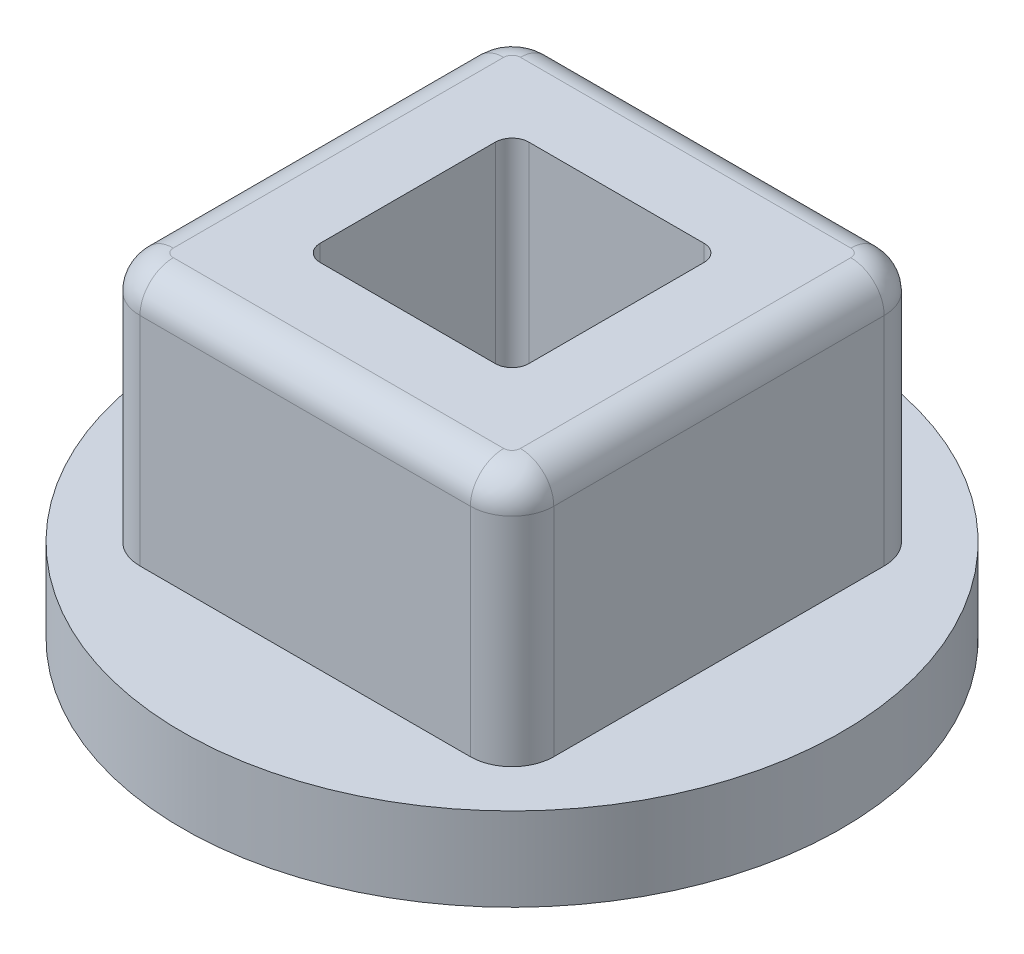
ISO-10303-21;
HEADER;
FILE_DESCRIPTION(('STEP AP214'),'2;1');
FILE_NAME('part.step','',(''),(''),'','','');
FILE_SCHEMA(('AUTOMOTIVE_DESIGN { 1 0 10303 214 1 1 1 1 }'));
ENDSEC;
DATA;
#1=APPLICATION_CONTEXT('core data for automotive mechanical design processes');
#2=APPLICATION_PROTOCOL_DEFINITION('international standard','automotive_design',2000,#1);
#3=PRODUCT_CONTEXT('',#1,'mechanical');
#4=PRODUCT('Part','Part','',(#3));
#5=PRODUCT_RELATED_PRODUCT_CATEGORY('part','',(#4));
#6=PRODUCT_DEFINITION_FORMATION('','',#4);
#7=PRODUCT_DEFINITION_CONTEXT('part definition',#1,'design');
#8=PRODUCT_DEFINITION('design','',#6,#7);
#9=PRODUCT_DEFINITION_SHAPE('','',#8);
#10=(LENGTH_UNIT() NAMED_UNIT(*) SI_UNIT(.MILLI.,.METRE.));
#11=(NAMED_UNIT(*) PLANE_ANGLE_UNIT() SI_UNIT($,.RADIAN.));
#12=(NAMED_UNIT(*) SI_UNIT($,.STERADIAN.) SOLID_ANGLE_UNIT());
#13=UNCERTAINTY_MEASURE_WITH_UNIT(LENGTH_MEASURE(1.E-05),#10,'distance_accuracy_value','');
#14=(GEOMETRIC_REPRESENTATION_CONTEXT(3) GLOBAL_UNCERTAINTY_ASSIGNED_CONTEXT((#13)) GLOBAL_UNIT_ASSIGNED_CONTEXT((#10,
#11,#12)) REPRESENTATION_CONTEXT('',''));
#15=CARTESIAN_POINT('',(0.,0.,0.));
#16=DIRECTION('',(0.,0.,1.));
#17=DIRECTION('',(1.,0.,0.));
#18=AXIS2_PLACEMENT_3D('',#15,#16,#17);
#19=CARTESIAN_POINT('',(-2.5146,5.08,2.5146));
#20=DIRECTION('',(0.,-1.,0.));
#21=DIRECTION('',(0.,0.,-1.));
#22=AXIS2_PLACEMENT_3D('',#19,#20,#21);
#23=CYLINDRICAL_SURFACE('',#22,0.635);
#24=DIRECTION('',(0.,1.,0.));
#25=VECTOR('',#24,1.);
#26=CARTESIAN_POINT('',(-3.1496,5.08,2.51460000000017));
#27=LINE('',#26,#25);
#28=CARTESIAN_POINT('',(-3.14960000000013,4.572,2.5146000000011));
#29=VERTEX_POINT('',#28);
#30=CARTESIAN_POINT('',(-3.1496,1.27,2.51460000000009));
#31=VERTEX_POINT('',#30);
#32=EDGE_CURVE('E98',#29,#31,#27,.F.);
#33=ORIENTED_EDGE('',*,*,#32,.T.);
#34=CARTESIAN_POINT('',(-2.5146,1.27,2.5146));
#35=DIRECTION('',(0.,-1.,0.));
#36=DIRECTION('',(0.,0.,-1.));
#37=AXIS2_PLACEMENT_3D('',#34,#35,#36);
#38=CIRCLE('',#37,0.635);
#39=CARTESIAN_POINT('',(-2.5146,1.27,3.1496));
#40=VERTEX_POINT('',#39);
#41=EDGE_CURVE('E19',#31,#40,#38,.F.);
#42=ORIENTED_EDGE('',*,*,#41,.T.);
#43=DIRECTION('',(0.,1.,0.));
#44=VECTOR('',#43,1.);
#45=CARTESIAN_POINT('',(-2.5146,5.08,3.1496));
#46=LINE('',#45,#44);
#47=CARTESIAN_POINT('',(-2.51460000000036,4.572,3.14959999999985));
#48=VERTEX_POINT('',#47);
#49=EDGE_CURVE('E96',#40,#48,#46,.T.);
#50=ORIENTED_EDGE('',*,*,#49,.T.);
#51=CARTESIAN_POINT('',(-2.51460000000043,4.572,2.51459999999958));
#52=DIRECTION('',(0.,-1.,0.));
#53=DIRECTION('',(0.,0.,-1.));
#54=AXIS2_PLACEMENT_3D('',#51,#52,#53);
#55=CIRCLE('',#54,0.634999999999828);
#56=EDGE_CURVE('E357',#29,#48,#55,.F.);
#57=ORIENTED_EDGE('',*,*,#56,.F.);
#58=EDGE_LOOP('',(#33,#42,#50,#57));
#59=FACE_BOUND('',#58,.T.);
#60=ADVANCED_FACE('F16',(#59),#23,.T.);
#61=CARTESIAN_POINT('',(-2.5146,5.08,-2.5146));
#62=DIRECTION('',(0.,-1.,0.));
#63=DIRECTION('',(0.,0.,-1.));
#64=AXIS2_PLACEMENT_3D('',#61,#62,#63);
#65=CYLINDRICAL_SURFACE('',#64,0.635);
#66=DIRECTION('',(0.,1.,0.));
#67=VECTOR('',#66,1.);
#68=CARTESIAN_POINT('',(-2.51460000000017,5.08,-3.1496));
#69=LINE('',#68,#67);
#70=CARTESIAN_POINT('',(-2.51459999999987,4.572,-3.14960000000006));
#71=VERTEX_POINT('',#70);
#72=CARTESIAN_POINT('',(-2.51460000000009,1.27,-3.1496));
#73=VERTEX_POINT('',#72);
#74=EDGE_CURVE('E245',#71,#73,#69,.F.);
#75=ORIENTED_EDGE('',*,*,#74,.T.);
#76=CARTESIAN_POINT('',(-2.5146,1.27,-2.5146));
#77=DIRECTION('',(0.,-1.,0.));
#78=DIRECTION('',(0.,0.,-1.));
#79=AXIS2_PLACEMENT_3D('',#76,#77,#78);
#80=CIRCLE('',#79,0.635);
#81=CARTESIAN_POINT('',(-3.1496,1.27,-2.5146));
#82=VERTEX_POINT('',#81);
#83=EDGE_CURVE('E100',#73,#82,#80,.F.);
#84=ORIENTED_EDGE('',*,*,#83,.T.);
#85=DIRECTION('',(0.,1.,0.));
#86=VECTOR('',#85,1.);
#87=CARTESIAN_POINT('',(-3.1496,5.08,-2.5146));
#88=LINE('',#87,#86);
#89=CARTESIAN_POINT('',(-3.1495999999997,4.572,-2.5146));
#90=VERTEX_POINT('',#89);
#91=EDGE_CURVE('E258',#82,#90,#88,.T.);
#92=ORIENTED_EDGE('',*,*,#91,.T.);
#93=CARTESIAN_POINT('',(-2.51459999999958,4.572,-2.51460000000043));
#94=DIRECTION('',(0.,-1.,0.));
#95=DIRECTION('',(0.,0.,-1.));
#96=AXIS2_PLACEMENT_3D('',#93,#94,#95);
#97=CIRCLE('',#96,0.634999999999828);
#98=EDGE_CURVE('E271',#71,#90,#97,.F.);
#99=ORIENTED_EDGE('',*,*,#98,.F.);
#100=EDGE_LOOP('',(#75,#84,#92,#99));
#101=FACE_BOUND('',#100,.T.);
#102=ADVANCED_FACE('F432',(#101),#65,.T.);
#103=CARTESIAN_POINT('',(2.5146,5.08,2.5146));
#104=DIRECTION('',(0.,-1.,0.));
#105=DIRECTION('',(0.,0.,-1.));
#106=AXIS2_PLACEMENT_3D('',#103,#104,#105);
#107=CYLINDRICAL_SURFACE('',#106,0.635);
#108=DIRECTION('',(0.,1.,0.));
#109=VECTOR('',#108,1.);
#110=CARTESIAN_POINT('',(2.51460000000009,5.08,3.1496));
#111=LINE('',#110,#109);
#112=CARTESIAN_POINT('',(2.51460000000106,4.572,3.14960000000013));
#113=VERTEX_POINT('',#112);
#114=CARTESIAN_POINT('',(2.51460000000004,1.27,3.1496));
#115=VERTEX_POINT('',#114);
#116=EDGE_CURVE('E261',#113,#115,#111,.F.);
#117=ORIENTED_EDGE('',*,*,#116,.T.);
#118=CARTESIAN_POINT('',(2.5146,1.27,2.5146));
#119=DIRECTION('',(0.,-1.,0.));
#120=DIRECTION('',(0.,0.,-1.));
#121=AXIS2_PLACEMENT_3D('',#118,#119,#120);
#122=CIRCLE('',#121,0.635);
#123=CARTESIAN_POINT('',(3.1496,1.27,2.5146));
#124=VERTEX_POINT('',#123);
#125=EDGE_CURVE('E113',#115,#124,#122,.F.);
#126=ORIENTED_EDGE('',*,*,#125,.T.);
#127=DIRECTION('',(0.,1.,0.));
#128=VECTOR('',#127,1.);
#129=CARTESIAN_POINT('',(3.1496,5.08,2.5146));
#130=LINE('',#129,#128);
#131=CARTESIAN_POINT('',(3.14959999999985,4.572,2.5146));
#132=VERTEX_POINT('',#131);
#133=EDGE_CURVE('E242',#124,#132,#130,.T.);
#134=ORIENTED_EDGE('',*,*,#133,.T.);
#135=CARTESIAN_POINT('',(2.51459999999958,4.572,2.51460000000043));
#136=DIRECTION('',(0.,-1.,0.));
#137=DIRECTION('',(0.,0.,-1.));
#138=AXIS2_PLACEMENT_3D('',#135,#136,#137);
#139=CIRCLE('',#138,0.634999999999828);
#140=EDGE_CURVE('E327',#113,#132,#139,.F.);
#141=ORIENTED_EDGE('',*,*,#140,.F.);
#142=EDGE_LOOP('',(#117,#126,#134,#141));
#143=FACE_BOUND('',#142,.T.);
#144=ADVANCED_FACE('F662',(#143),#107,.T.);
#145=CARTESIAN_POINT('',(2.5146,5.08,-2.5146));
#146=DIRECTION('',(0.,-1.,0.));
#147=DIRECTION('',(0.,0.,-1.));
#148=AXIS2_PLACEMENT_3D('',#145,#146,#147);
#149=CYLINDRICAL_SURFACE('',#148,0.635);
#150=DIRECTION('',(0.,1.,0.));
#151=VECTOR('',#150,1.);
#152=CARTESIAN_POINT('',(3.1496,5.08,-2.51460000000017));
#153=LINE('',#152,#151);
#154=CARTESIAN_POINT('',(3.14960000000013,4.572,-2.5146000000011));
#155=VERTEX_POINT('',#154);
#156=CARTESIAN_POINT('',(3.1496,1.27,-2.51460000000009));
#157=VERTEX_POINT('',#156);
#158=EDGE_CURVE('E235',#155,#157,#153,.F.);
#159=ORIENTED_EDGE('',*,*,#158,.T.);
#160=CARTESIAN_POINT('',(2.5146,1.27,-2.5146));
#161=DIRECTION('',(0.,-1.,0.));
#162=DIRECTION('',(0.,0.,-1.));
#163=AXIS2_PLACEMENT_3D('',#160,#161,#162);
#164=CIRCLE('',#163,0.635);
#165=CARTESIAN_POINT('',(2.5146,1.27,-3.1496));
#166=VERTEX_POINT('',#165);
#167=EDGE_CURVE('E378',#157,#166,#164,.F.);
#168=ORIENTED_EDGE('',*,*,#167,.T.);
#169=DIRECTION('',(0.,1.,0.));
#170=VECTOR('',#169,1.);
#171=CARTESIAN_POINT('',(2.5146,5.08,-3.1496));
#172=LINE('',#171,#170);
#173=CARTESIAN_POINT('',(2.51460000000011,4.572,-3.14959999999985));
#174=VERTEX_POINT('',#173);
#175=EDGE_CURVE('E248',#166,#174,#172,.T.);
#176=ORIENTED_EDGE('',*,*,#175,.T.);
#177=CARTESIAN_POINT('',(2.51460000000043,4.572,-2.51459999999958));
#178=DIRECTION('',(0.,-1.,0.));
#179=DIRECTION('',(0.,0.,-1.));
#180=AXIS2_PLACEMENT_3D('',#177,#178,#179);
#181=CIRCLE('',#180,0.634999999999828);
#182=EDGE_CURVE('E298',#155,#174,#181,.F.);
#183=ORIENTED_EDGE('',*,*,#182,.F.);
#184=EDGE_LOOP('',(#159,#168,#176,#183));
#185=FACE_BOUND('',#184,.T.);
#186=ADVANCED_FACE('F498',(#185),#149,.T.);
#187=CARTESIAN_POINT('',(-2.6416,4.572,2.538898108304));
#188=DIRECTION('',(0.,0.,-1.));
#189=DIRECTION('',(-1.,0.,0.));
#190=AXIS2_PLACEMENT_3D('',#187,#188,#189);
#191=CYLINDRICAL_SURFACE('',#190,0.508);
#192=CARTESIAN_POINT('',(-2.64160000000059,4.57200000000093,2.51460000000007));
#193=DIRECTION('',(-3.86198346587602E-12,0.,-1.));
#194=DIRECTION('',(-1.,0.,3.86198346587602E-12));
#195=AXIS2_PLACEMENT_3D('',#192,#193,#194);
#196=CIRCLE('',#195,0.507999999999662);
#197=CARTESIAN_POINT('',(-2.6415999981047,5.08000000000029,2.51460000000007));
#198=VERTEX_POINT('',#197);
#199=EDGE_CURVE('E202',#198,#29,#196,.F.);
#200=ORIENTED_EDGE('',*,*,#199,.F.);
#201=DIRECTION('',(0.,0.,1.));
#202=VECTOR('',#201,1.);
#203=CARTESIAN_POINT('',(-2.6416,5.08,3.1496));
#204=LINE('',#203,#202);
#205=CARTESIAN_POINT('',(-2.64159999999994,5.08000000000029,-2.51460000000017));
#206=VERTEX_POINT('',#205);
#207=EDGE_CURVE('E188',#206,#198,#204,.T.);
#208=ORIENTED_EDGE('',*,*,#207,.F.);
#209=CARTESIAN_POINT('',(-2.64159999999975,4.57200000000093,-2.51460000000034));
#210=DIRECTION('',(-6.69870225473767E-13,0.,-1.));
#211=DIRECTION('',(-1.,0.,6.69870225473767E-13));
#212=AXIS2_PLACEMENT_3D('',#209,#210,#211);
#213=CIRCLE('',#212,0.507999999999662);
#214=EDGE_CURVE('E109',#90,#206,#213,.T.);
#215=ORIENTED_EDGE('',*,*,#214,.F.);
#216=DIRECTION('',(0.,0.,-1.));
#217=VECTOR('',#216,1.);
#218=CARTESIAN_POINT('',(-3.1496,4.572,-3.1496));
#219=LINE('',#218,#217);
#220=EDGE_CURVE('E255',#90,#29,#219,.F.);
#221=ORIENTED_EDGE('',*,*,#220,.T.);
#222=EDGE_LOOP('',(#200,#208,#215,#221));
#223=FACE_BOUND('',#222,.T.);
#224=ADVANCED_FACE('F199',(#223),#191,.T.);
#225=CARTESIAN_POINT('',(-2.51460000000043,4.57200000000093,2.38759999999941));
#226=DIRECTION('',(1.,0.,0.));
#227=DIRECTION('',(0.,0.,-1.));
#228=AXIS2_PLACEMENT_3D('',#225,#226,#227);
#229=CIRCLE('',#228,0.507999999999662);
#230=TRIMMED_CURVE('',#229,(PARAMETER_VALUE(-1.82347658193748)),
(PARAMETER_VALUE(1.82347658193748)),.T.,.PARAMETER.);
#231=CARTESIAN_POINT('',(-2.51460000000043,4.57200000000093,2.51459999999958));
#232=DIRECTION('',(0.,-1.,0.));
#233=AXIS1_PLACEMENT('',#231,#232);
#234=SURFACE_OF_REVOLUTION('',#230,#233);
#235=CARTESIAN_POINT('',(-2.51460000000014,4.572,2.6416));
#236=DIRECTION('',(-1.,0.,0.));
#237=DIRECTION('',(0.,0.,1.));
#238=AXIS2_PLACEMENT_3D('',#235,#236,#237);
#239=CIRCLE('',#238,0.508);
#240=CARTESIAN_POINT('',(-2.51460000000025,5.08000000000015,2.64159999778818));
#241=VERTEX_POINT('',#240);
#242=EDGE_CURVE('E352',#241,#48,#239,.F.);
#243=ORIENTED_EDGE('',*,*,#242,.F.);
#244=CARTESIAN_POINT('',(-2.51460000000043,5.08000000000059,2.51459999999958));
#245=DIRECTION('',(0.,-1.,0.));
#246=DIRECTION('',(-1.37958325052589E-12,0.,1.));
#247=AXIS2_PLACEMENT_3D('',#244,#245,#246);
#248=CIRCLE('',#247,0.126999998736481);
#249=EDGE_CURVE('E131',#198,#241,#248,.F.);
#250=ORIENTED_EDGE('',*,*,#249,.F.);
#251=ORIENTED_EDGE('',*,*,#199,.T.);
#252=ORIENTED_EDGE('',*,*,#56,.T.);
#253=EDGE_LOOP('',(#243,#250,#251,#252));
#254=FACE_BOUND('',#253,.T.);
#255=ADVANCED_FACE('F363',(#254),#234,.F.);
#256=CARTESIAN_POINT('',(2.538898108304,4.572,2.6416));
#257=DIRECTION('',(-1.,0.,0.));
#258=DIRECTION('',(0.,0.,1.));
#259=AXIS2_PLACEMENT_3D('',#256,#257,#258);
#260=CYLINDRICAL_SURFACE('',#259,0.508);
#261=CARTESIAN_POINT('',(2.51460000000007,4.57200000000093,2.64160000000059));
#262=DIRECTION('',(-1.,0.,3.86902766089366E-12));
#263=DIRECTION('',(3.86902766089366E-12,0.,1.));
#264=AXIS2_PLACEMENT_3D('',#261,#262,#263);
#265=CIRCLE('',#264,0.507999999999662);
#266=CARTESIAN_POINT('',(2.51460000000007,5.08000000000029,2.64159999873631));
#267=VERTEX_POINT('',#266);
#268=EDGE_CURVE('E344',#267,#113,#265,.F.);
#269=ORIENTED_EDGE('',*,*,#268,.F.);
#270=DIRECTION('',(1.,0.,0.));
#271=VECTOR('',#270,1.);
#272=CARTESIAN_POINT('',(-3.1496,5.08,2.64159999747237));
#273=LINE('',#272,#271);
#274=EDGE_CURVE('E205',#241,#267,#273,.T.);
#275=ORIENTED_EDGE('',*,*,#274,.F.);
#276=ORIENTED_EDGE('',*,*,#242,.T.);
#277=DIRECTION('',(-1.,0.,0.));
#278=VECTOR('',#277,1.);
#279=CARTESIAN_POINT('',(-3.1496,4.572,3.1496));
#280=LINE('',#279,#278);
#281=EDGE_CURVE('E108',#48,#113,#280,.F.);
#282=ORIENTED_EDGE('',*,*,#281,.T.);
#283=EDGE_LOOP('',(#269,#275,#276,#282));
#284=FACE_BOUND('',#283,.T.);
#285=ADVANCED_FACE('F338',(#284),#260,.T.);
#286=CARTESIAN_POINT('',(2.51459999999958,4.57200000000093,2.38760000000026));
#287=DIRECTION('',(1.,0.,0.));
#288=DIRECTION('',(0.,0.,-1.));
#289=AXIS2_PLACEMENT_3D('',#286,#287,#288);
#290=CIRCLE('',#289,0.507999999999662);
#291=TRIMMED_CURVE('',#290,(PARAMETER_VALUE(-1.82347658193748)),
(PARAMETER_VALUE(1.82347658193748)),.T.,.PARAMETER.);
#292=CARTESIAN_POINT('',(2.51459999999958,4.57200000000093,2.51460000000043));
#293=DIRECTION('',(0.,-1.,0.));
#294=AXIS1_PLACEMENT('',#292,#293);
#295=SURFACE_OF_REVOLUTION('',#291,#294);
#296=CARTESIAN_POINT('',(2.6416,4.572,2.5146));
#297=DIRECTION('',(0.,0.,1.));
#298=DIRECTION('',(1.,0.,0.));
#299=AXIS2_PLACEMENT_3D('',#296,#297,#298);
#300=CIRCLE('',#299,0.508);
#301=CARTESIAN_POINT('',(2.64159999936797,5.08000000000015,2.51460000000008));
#302=VERTEX_POINT('',#301);
#303=EDGE_CURVE('E322',#302,#132,#300,.F.);
#304=ORIENTED_EDGE('',*,*,#303,.F.);
#305=CARTESIAN_POINT('',(2.51459999999958,5.08000000000059,2.51460000000043));
#306=DIRECTION('',(0.,-1.,0.));
#307=DIRECTION('',(1.,0.,-6.72717568438272E-13));
#308=AXIS2_PLACEMENT_3D('',#305,#306,#307);
#309=CIRCLE('',#308,0.127000000000293);
#310=EDGE_CURVE('E512',#267,#302,#309,.F.);
#311=ORIENTED_EDGE('',*,*,#310,.F.);
#312=ORIENTED_EDGE('',*,*,#268,.T.);
#313=ORIENTED_EDGE('',*,*,#140,.T.);
#314=EDGE_LOOP('',(#304,#311,#312,#313));
#315=FACE_BOUND('',#314,.T.);
#316=ADVANCED_FACE('F334',(#315),#295,.F.);
#317=CARTESIAN_POINT('',(2.6416,4.572,-2.538898108304));
#318=DIRECTION('',(0.,0.,1.));
#319=DIRECTION('',(1.,0.,0.));
#320=AXIS2_PLACEMENT_3D('',#317,#318,#319);
#321=CYLINDRICAL_SURFACE('',#320,0.508);
#322=CARTESIAN_POINT('',(2.64160000000059,4.57200000000093,-2.51460000000007));
#323=DIRECTION('',(3.86563575947983E-12,0.,1.));
#324=DIRECTION('',(1.,0.,-3.86563575947983E-12));
#325=AXIS2_PLACEMENT_3D('',#322,#323,#324);
#326=CIRCLE('',#325,0.507999999999662);
#327=CARTESIAN_POINT('',(2.64159999873636,5.08000000000029,-2.51460000000007));
#328=VERTEX_POINT('',#327);
#329=EDGE_CURVE('E314',#328,#155,#326,.F.);
#330=ORIENTED_EDGE('',*,*,#329,.F.);
#331=DIRECTION('',(0.,0.,1.));
#332=VECTOR('',#331,1.);
#333=CARTESIAN_POINT('',(2.6416,5.08,3.1496));
#334=LINE('',#333,#332);
#335=EDGE_CURVE('E516',#302,#328,#334,.F.);
#336=ORIENTED_EDGE('',*,*,#335,.F.);
#337=ORIENTED_EDGE('',*,*,#303,.T.);
#338=DIRECTION('',(0.,0.,1.));
#339=VECTOR('',#338,1.);
#340=CARTESIAN_POINT('',(3.1496,4.572,-3.1496));
#341=LINE('',#340,#339);
#342=EDGE_CURVE('E239',#132,#155,#341,.F.);
#343=ORIENTED_EDGE('',*,*,#342,.T.);
#344=EDGE_LOOP('',(#330,#336,#337,#343));
#345=FACE_BOUND('',#344,.T.);
#346=ADVANCED_FACE('F308',(#345),#321,.T.);
#347=CARTESIAN_POINT('',(2.51460000000043,4.57200000000093,-2.64159999999975));
#348=DIRECTION('',(1.,0.,0.));
#349=DIRECTION('',(0.,0.,-1.));
#350=AXIS2_PLACEMENT_3D('',#347,#348,#349);
#351=CIRCLE('',#350,0.507999999999662);
#352=TRIMMED_CURVE('',#351,(PARAMETER_VALUE(-1.82347658193748)),
(PARAMETER_VALUE(1.82347658193748)),.T.,.PARAMETER.);
#353=CARTESIAN_POINT('',(2.51460000000043,4.57200000000093,-2.51459999999958));
#354=DIRECTION('',(0.,-1.,0.));
#355=AXIS1_PLACEMENT('',#353,#354);
#356=SURFACE_OF_REVOLUTION('',#352,#355);
#357=CARTESIAN_POINT('',(2.5146,4.572,-2.6416));
#358=DIRECTION('',(1.,0.,0.));
#359=DIRECTION('',(0.,0.,-1.));
#360=AXIS2_PLACEMENT_3D('',#357,#358,#359);
#361=CIRCLE('',#360,0.508);
#362=CARTESIAN_POINT('',(2.51460000000011,5.08000000000015,-2.64159999936809));
#363=VERTEX_POINT('',#362);
#364=EDGE_CURVE('E294',#363,#174,#361,.F.);
#365=ORIENTED_EDGE('',*,*,#364,.F.);
#366=CARTESIAN_POINT('',(2.51460000000043,5.08000000000059,-2.51459999999958));
#367=DIRECTION('',(0.,-1.,0.));
#368=DIRECTION('',(0.,0.,-1.));
#369=AXIS2_PLACEMENT_3D('',#366,#367,#368);
#370=CIRCLE('',#369,0.127000000000293);
#371=EDGE_CURVE('E174',#328,#363,#370,.F.);
#372=ORIENTED_EDGE('',*,*,#371,.F.);
#373=ORIENTED_EDGE('',*,*,#329,.T.);
#374=ORIENTED_EDGE('',*,*,#182,.T.);
#375=EDGE_LOOP('',(#365,#372,#373,#374));
#376=FACE_BOUND('',#375,.T.);
#377=ADVANCED_FACE('F304',(#376),#356,.F.);
#378=CARTESIAN_POINT('',(-2.538898108304,4.572,-2.6416));
#379=DIRECTION('',(1.,0.,0.));
#380=DIRECTION('',(0.,0.,-1.));
#381=AXIS2_PLACEMENT_3D('',#378,#379,#380);
#382=CYLINDRICAL_SURFACE('',#381,0.508);
#383=CARTESIAN_POINT('',(-2.51460000000017,4.572,-2.6416));
#384=DIRECTION('',(1.,0.,0.));
#385=DIRECTION('',(0.,0.,-1.));
#386=AXIS2_PLACEMENT_3D('',#383,#384,#385);
#387=CIRCLE('',#386,0.508);
#388=CARTESIAN_POINT('',(-2.51459999999989,5.08000000000024,-2.64159999797814));
#389=VERTEX_POINT('',#388);
#390=EDGE_CURVE('E297',#389,#71,#387,.F.);
#391=ORIENTED_EDGE('',*,*,#390,.F.);
#392=DIRECTION('',(1.,0.,0.));
#393=VECTOR('',#392,1.);
#394=CARTESIAN_POINT('',(-3.1496,5.08,-2.6416));
#395=LINE('',#394,#393);
#396=EDGE_CURVE('E121',#363,#389,#395,.F.);
#397=ORIENTED_EDGE('',*,*,#396,.F.);
#398=ORIENTED_EDGE('',*,*,#364,.T.);
#399=DIRECTION('',(1.,0.,0.));
#400=VECTOR('',#399,1.);
#401=CARTESIAN_POINT('',(-3.1496,4.572,-3.1496));
#402=LINE('',#401,#400);
#403=EDGE_CURVE('E251',#174,#71,#402,.F.);
#404=ORIENTED_EDGE('',*,*,#403,.T.);
#405=EDGE_LOOP('',(#391,#397,#398,#404));
#406=FACE_BOUND('',#405,.T.);
#407=ADVANCED_FACE('F279',(#406),#382,.T.);
#408=CARTESIAN_POINT('',(-2.51459999999958,4.57200000000093,-2.64160000000059));
#409=DIRECTION('',(1.,0.,0.));
#410=DIRECTION('',(0.,0.,-1.));
#411=AXIS2_PLACEMENT_3D('',#408,#409,#410);
#412=CIRCLE('',#411,0.507999999999662);
#413=TRIMMED_CURVE('',#412,(PARAMETER_VALUE(-1.82347658193748)),
(PARAMETER_VALUE(1.82347658193748)),.T.,.PARAMETER.);
#414=CARTESIAN_POINT('',(-2.51459999999958,4.57200000000093,-2.51460000000043));
#415=DIRECTION('',(0.,-1.,0.));
#416=AXIS1_PLACEMENT('',#414,#415);
#417=SURFACE_OF_REVOLUTION('',#413,#416);
#418=ORIENTED_EDGE('',*,*,#214,.T.);
#419=CARTESIAN_POINT('',(-2.51459999999958,5.08000000000059,-2.51460000000043));
#420=DIRECTION('',(0.,-1.,0.));
#421=DIRECTION('',(-1.,0.,6.72717568438272E-13));
#422=AXIS2_PLACEMENT_3D('',#419,#420,#421);
#423=CIRCLE('',#422,0.127000000000293);
#424=EDGE_CURVE('E116',#389,#206,#423,.F.);
#425=ORIENTED_EDGE('',*,*,#424,.F.);
#426=ORIENTED_EDGE('',*,*,#390,.T.);
#427=ORIENTED_EDGE('',*,*,#98,.T.);
#428=EDGE_LOOP('',(#418,#425,#426,#427));
#429=FACE_BOUND('',#428,.T.);
#430=ADVANCED_FACE('F274',(#429),#417,.F.);
#431=CARTESIAN_POINT('',(-3.1496,5.08,3.1496));
#432=DIRECTION('',(0.,0.,-1.));
#433=DIRECTION('',(-1.,0.,0.));
#434=AXIS2_PLACEMENT_3D('',#431,#432,#433);
#435=PLANE('',#434);
#436=ORIENTED_EDGE('',*,*,#116,.F.);
#437=ORIENTED_EDGE('',*,*,#281,.F.);
#438=ORIENTED_EDGE('',*,*,#49,.F.);
#439=DIRECTION('',(1.,0.,0.));
#440=VECTOR('',#439,1.);
#441=CARTESIAN_POINT('',(0.,1.27,3.1496));
#442=LINE('',#441,#440);
#443=EDGE_CURVE('E106',#115,#40,#442,.F.);
#444=ORIENTED_EDGE('',*,*,#443,.F.);
#445=EDGE_LOOP('',(#436,#437,#438,#444));
#446=FACE_BOUND('',#445,.T.);
#447=ADVANCED_FACE('F105',(#446),#435,.F.);
#448=CARTESIAN_POINT('',(-3.1496,5.08,-3.1496));
#449=DIRECTION('',(1.,0.,0.));
#450=DIRECTION('',(0.,0.,-1.));
#451=AXIS2_PLACEMENT_3D('',#448,#449,#450);
#452=PLANE('',#451);
#453=ORIENTED_EDGE('',*,*,#32,.F.);
#454=ORIENTED_EDGE('',*,*,#220,.F.);
#455=ORIENTED_EDGE('',*,*,#91,.F.);
#456=DIRECTION('',(0.,0.,1.));
#457=VECTOR('',#456,1.);
#458=CARTESIAN_POINT('',(-3.1496,1.27,0.));
#459=LINE('',#458,#457);
#460=EDGE_CURVE('E115',#31,#82,#459,.F.);
#461=ORIENTED_EDGE('',*,*,#460,.F.);
#462=EDGE_LOOP('',(#453,#454,#455,#461));
#463=FACE_BOUND('',#462,.T.);
#464=ADVANCED_FACE('F439',(#463),#452,.F.);
#465=CARTESIAN_POINT('',(-3.1496,5.08,-3.1496));
#466=DIRECTION('',(0.,0.,1.));
#467=DIRECTION('',(1.,0.,0.));
#468=AXIS2_PLACEMENT_3D('',#465,#466,#467);
#469=PLANE('',#468);
#470=ORIENTED_EDGE('',*,*,#74,.F.);
#471=ORIENTED_EDGE('',*,*,#403,.F.);
#472=ORIENTED_EDGE('',*,*,#175,.F.);
#473=DIRECTION('',(1.,0.,0.));
#474=VECTOR('',#473,1.);
#475=CARTESIAN_POINT('',(0.,1.27,-3.1496));
#476=LINE('',#475,#474);
#477=EDGE_CURVE('E118',#73,#166,#476,.T.);
#478=ORIENTED_EDGE('',*,*,#477,.F.);
#479=EDGE_LOOP('',(#470,#471,#472,#478));
#480=FACE_BOUND('',#479,.T.);
#481=ADVANCED_FACE('F493',(#480),#469,.F.);
#482=CARTESIAN_POINT('',(3.1496,5.08,-3.1496));
#483=DIRECTION('',(-1.,0.,0.));
#484=DIRECTION('',(0.,0.,1.));
#485=AXIS2_PLACEMENT_3D('',#482,#483,#484);
#486=PLANE('',#485);
#487=ORIENTED_EDGE('',*,*,#158,.F.);
#488=ORIENTED_EDGE('',*,*,#342,.F.);
#489=ORIENTED_EDGE('',*,*,#133,.F.);
#490=DIRECTION('',(0.,0.,1.));
#491=VECTOR('',#490,1.);
#492=CARTESIAN_POINT('',(3.1496,1.27,0.));
#493=LINE('',#492,#491);
#494=EDGE_CURVE('E488',#157,#124,#493,.T.);
#495=ORIENTED_EDGE('',*,*,#494,.F.);
#496=EDGE_LOOP('',(#487,#488,#489,#495));
#497=FACE_BOUND('',#496,.T.);
#498=ADVANCED_FACE('F584',(#497),#486,.F.);
#499=CARTESIAN_POINT('',(1.3335,5.08,-1.3335));
#500=DIRECTION('',(0.,1.,0.));
#501=DIRECTION('',(0.,0.,1.));
#502=AXIS2_PLACEMENT_3D('',#499,#500,#501);
#503=CYLINDRICAL_SURFACE('',#502,0.254);
#504=DIRECTION('',(0.,1.,0.));
#505=VECTOR('',#504,1.);
#506=CARTESIAN_POINT('',(1.5875,5.08,-1.3335));
#507=LINE('',#506,#505);
#508=CARTESIAN_POINT('',(1.5875,0.,-1.3335));
#509=VERTEX_POINT('',#508);
#510=CARTESIAN_POINT('',(1.5875,5.08,-1.3335));
#511=VERTEX_POINT('',#510);
#512=EDGE_CURVE('E229',#509,#511,#507,.T.);
#513=ORIENTED_EDGE('',*,*,#512,.T.);
#514=CARTESIAN_POINT('',(1.3335,5.08,-1.3335));
#515=DIRECTION('',(0.,1.,0.));
#516=DIRECTION('',(0.,0.,1.));
#517=AXIS2_PLACEMENT_3D('',#514,#515,#516);
#518=CIRCLE('',#517,0.254);
#519=CARTESIAN_POINT('',(1.3335,5.08,-1.5875));
#520=VERTEX_POINT('',#519);
#521=EDGE_CURVE('E203',#520,#511,#518,.F.);
#522=ORIENTED_EDGE('',*,*,#521,.F.);
#523=DIRECTION('',(0.,1.,0.));
#524=VECTOR('',#523,1.);
#525=CARTESIAN_POINT('',(1.3335,5.08,-1.5875));
#526=LINE('',#525,#524);
#527=CARTESIAN_POINT('',(1.3335,0.,-1.5875));
#528=VERTEX_POINT('',#527);
#529=EDGE_CURVE('E233',#520,#528,#526,.F.);
#530=ORIENTED_EDGE('',*,*,#529,.T.);
#531=CARTESIAN_POINT('',(1.3335,0.,-1.3335));
#532=DIRECTION('',(0.,1.,0.));
#533=DIRECTION('',(0.,0.,1.));
#534=AXIS2_PLACEMENT_3D('',#531,#532,#533);
#535=CIRCLE('',#534,0.254);
#536=EDGE_CURVE('E238',#509,#528,#535,.T.);
#537=ORIENTED_EDGE('',*,*,#536,.F.);
#538=EDGE_LOOP('',(#513,#522,#530,#537));
#539=FACE_BOUND('',#538,.T.);
#540=ADVANCED_FACE('F582',(#539),#503,.F.);
#541=CARTESIAN_POINT('',(1.3335,5.08,1.3335));
#542=DIRECTION('',(0.,1.,0.));
#543=DIRECTION('',(0.,0.,1.));
#544=AXIS2_PLACEMENT_3D('',#541,#542,#543);
#545=CYLINDRICAL_SURFACE('',#544,0.254);
#546=DIRECTION('',(0.,1.,0.));
#547=VECTOR('',#546,1.);
#548=CARTESIAN_POINT('',(1.3335,5.08,1.5875));
#549=LINE('',#548,#547);
#550=CARTESIAN_POINT('',(1.3335,0.,1.5875));
#551=VERTEX_POINT('',#550);
#552=CARTESIAN_POINT('',(1.3335,5.08,1.5875));
#553=VERTEX_POINT('',#552);
#554=EDGE_CURVE('E224',#551,#553,#549,.T.);
#555=ORIENTED_EDGE('',*,*,#554,.T.);
#556=CARTESIAN_POINT('',(1.3335,5.08,1.3335));
#557=DIRECTION('',(0.,1.,0.));
#558=DIRECTION('',(0.,0.,1.));
#559=AXIS2_PLACEMENT_3D('',#556,#557,#558);
#560=CIRCLE('',#559,0.254);
#561=CARTESIAN_POINT('',(1.5875,5.08,1.3335));
#562=VERTEX_POINT('',#561);
#563=EDGE_CURVE('E415',#562,#553,#560,.F.);
#564=ORIENTED_EDGE('',*,*,#563,.F.);
#565=DIRECTION('',(0.,1.,0.));
#566=VECTOR('',#565,1.);
#567=CARTESIAN_POINT('',(1.5875,5.08,1.3335));
#568=LINE('',#567,#566);
#569=CARTESIAN_POINT('',(1.5875,0.,1.3335));
#570=VERTEX_POINT('',#569);
#571=EDGE_CURVE('E228',#562,#570,#568,.F.);
#572=ORIENTED_EDGE('',*,*,#571,.T.);
#573=CARTESIAN_POINT('',(1.3335,0.,1.3335));
#574=DIRECTION('',(0.,1.,0.));
#575=DIRECTION('',(0.,0.,1.));
#576=AXIS2_PLACEMENT_3D('',#573,#574,#575);
#577=CIRCLE('',#576,0.254);
#578=EDGE_CURVE('E421',#551,#570,#577,.T.);
#579=ORIENTED_EDGE('',*,*,#578,.F.);
#580=EDGE_LOOP('',(#555,#564,#572,#579));
#581=FACE_BOUND('',#580,.T.);
#582=ADVANCED_FACE('F476',(#581),#545,.F.);
#583=CARTESIAN_POINT('',(-1.3335,5.08,-1.3335));
#584=DIRECTION('',(0.,1.,0.));
#585=DIRECTION('',(0.,0.,1.));
#586=AXIS2_PLACEMENT_3D('',#583,#584,#585);
#587=CYLINDRICAL_SURFACE('',#586,0.254);
#588=DIRECTION('',(0.,1.,0.));
#589=VECTOR('',#588,1.);
#590=CARTESIAN_POINT('',(-1.3335,5.08,-1.5875));
#591=LINE('',#590,#589);
#592=CARTESIAN_POINT('',(-1.3335,0.,-1.5875));
#593=VERTEX_POINT('',#592);
#594=CARTESIAN_POINT('',(-1.3335,5.08,-1.5875));
#595=VERTEX_POINT('',#594);
#596=EDGE_CURVE('E234',#593,#595,#591,.T.);
#597=ORIENTED_EDGE('',*,*,#596,.T.);
#598=CARTESIAN_POINT('',(-1.3335,5.08,-1.3335));
#599=DIRECTION('',(0.,1.,0.));
#600=DIRECTION('',(0.,0.,1.));
#601=AXIS2_PLACEMENT_3D('',#598,#599,#600);
#602=CIRCLE('',#601,0.254);
#603=CARTESIAN_POINT('',(-1.5875,5.08,-1.3335));
#604=VERTEX_POINT('',#603);
#605=EDGE_CURVE('E207',#604,#595,#602,.F.);
#606=ORIENTED_EDGE('',*,*,#605,.F.);
#607=DIRECTION('',(0.,1.,0.));
#608=VECTOR('',#607,1.);
#609=CARTESIAN_POINT('',(-1.5875,5.08,-1.3335));
#610=LINE('',#609,#608);
#611=CARTESIAN_POINT('',(-1.5875,0.,-1.3335));
#612=VERTEX_POINT('',#611);
#613=EDGE_CURVE('E481',#604,#612,#610,.F.);
#614=ORIENTED_EDGE('',*,*,#613,.T.);
#615=CARTESIAN_POINT('',(-1.3335,0.,-1.3335));
#616=DIRECTION('',(0.,1.,0.));
#617=DIRECTION('',(0.,0.,1.));
#618=AXIS2_PLACEMENT_3D('',#615,#616,#617);
#619=CIRCLE('',#618,0.254);
#620=EDGE_CURVE('E419',#593,#612,#619,.T.);
#621=ORIENTED_EDGE('',*,*,#620,.F.);
#622=EDGE_LOOP('',(#597,#606,#614,#621));
#623=FACE_BOUND('',#622,.T.);
#624=ADVANCED_FACE('F570',(#623),#587,.F.);
#625=CARTESIAN_POINT('',(-1.3335,5.08,1.3335));
#626=DIRECTION('',(0.,1.,0.));
#627=DIRECTION('',(0.,0.,1.));
#628=AXIS2_PLACEMENT_3D('',#625,#626,#627);
#629=CYLINDRICAL_SURFACE('',#628,0.254);
#630=DIRECTION('',(0.,1.,0.));
#631=VECTOR('',#630,1.);
#632=CARTESIAN_POINT('',(-1.5875,5.08,1.3335));
#633=LINE('',#632,#631);
#634=CARTESIAN_POINT('',(-1.5875,0.,1.3335));
#635=VERTEX_POINT('',#634);
#636=CARTESIAN_POINT('',(-1.5875,5.08,1.3335));
#637=VERTEX_POINT('',#636);
#638=EDGE_CURVE('E219',#635,#637,#633,.T.);
#639=ORIENTED_EDGE('',*,*,#638,.T.);
#640=CARTESIAN_POINT('',(-1.3335,5.08,1.3335));
#641=DIRECTION('',(0.,1.,0.));
#642=DIRECTION('',(0.,0.,1.));
#643=AXIS2_PLACEMENT_3D('',#640,#641,#642);
#644=CIRCLE('',#643,0.254);
#645=CARTESIAN_POINT('',(-1.3335,5.08,1.5875));
#646=VERTEX_POINT('',#645);
#647=EDGE_CURVE('E412',#646,#637,#644,.F.);
#648=ORIENTED_EDGE('',*,*,#647,.F.);
#649=DIRECTION('',(0.,1.,0.));
#650=VECTOR('',#649,1.);
#651=CARTESIAN_POINT('',(-1.3335,5.08,1.5875));
#652=LINE('',#651,#650);
#653=CARTESIAN_POINT('',(-1.3335,0.,1.5875));
#654=VERTEX_POINT('',#653);
#655=EDGE_CURVE('E223',#646,#654,#652,.F.);
#656=ORIENTED_EDGE('',*,*,#655,.T.);
#657=CARTESIAN_POINT('',(-1.3335,0.,1.3335));
#658=DIRECTION('',(0.,1.,0.));
#659=DIRECTION('',(0.,0.,1.));
#660=AXIS2_PLACEMENT_3D('',#657,#658,#659);
#661=CIRCLE('',#660,0.254);
#662=EDGE_CURVE('E34',#635,#654,#661,.T.);
#663=ORIENTED_EDGE('',*,*,#662,.F.);
#664=EDGE_LOOP('',(#639,#648,#656,#663));
#665=FACE_BOUND('',#664,.T.);
#666=ADVANCED_FACE('F149',(#665),#629,.F.);
#667=CARTESIAN_POINT('',(-3.1496,5.08,3.1496));
#668=DIRECTION('',(0.,1.,0.));
#669=DIRECTION('',(0.,0.,1.));
#670=AXIS2_PLACEMENT_3D('',#667,#668,#669);
#671=PLANE('',#670);
#672=ORIENTED_EDGE('',*,*,#396,.T.);
#673=ORIENTED_EDGE('',*,*,#424,.T.);
#674=ORIENTED_EDGE('',*,*,#207,.T.);
#675=ORIENTED_EDGE('',*,*,#249,.T.);
#676=ORIENTED_EDGE('',*,*,#274,.T.);
#677=ORIENTED_EDGE('',*,*,#310,.T.);
#678=ORIENTED_EDGE('',*,*,#335,.T.);
#679=ORIENTED_EDGE('',*,*,#371,.T.);
#680=EDGE_LOOP('',(#672,#673,#674,#675,#676,#677,#678,#679));
#681=FACE_BOUND('',#680,.T.);
#682=ORIENTED_EDGE('',*,*,#521,.T.);
#683=DIRECTION('',(0.,0.,-1.));
#684=VECTOR('',#683,1.);
#685=CARTESIAN_POINT('',(1.5875,5.08,1.5875));
#686=LINE('',#685,#684);
#687=EDGE_CURVE('E225',#511,#562,#686,.F.);
#688=ORIENTED_EDGE('',*,*,#687,.T.);
#689=ORIENTED_EDGE('',*,*,#563,.T.);
#690=DIRECTION('',(1.,0.,0.));
#691=VECTOR('',#690,1.);
#692=CARTESIAN_POINT('',(-1.5875,5.08,1.5875));
#693=LINE('',#692,#691);
#694=EDGE_CURVE('E220',#553,#646,#693,.F.);
#695=ORIENTED_EDGE('',*,*,#694,.T.);
#696=ORIENTED_EDGE('',*,*,#647,.T.);
#697=DIRECTION('',(0.,0.,1.));
#698=VECTOR('',#697,1.);
#699=CARTESIAN_POINT('',(-1.5875,5.08,1.5875));
#700=LINE('',#699,#698);
#701=EDGE_CURVE('E215',#637,#604,#700,.F.);
#702=ORIENTED_EDGE('',*,*,#701,.T.);
#703=ORIENTED_EDGE('',*,*,#605,.T.);
#704=DIRECTION('',(-1.,0.,0.));
#705=VECTOR('',#704,1.);
#706=CARTESIAN_POINT('',(-1.5875,5.08,-1.5875));
#707=LINE('',#706,#705);
#708=EDGE_CURVE('E230',#595,#520,#707,.F.);
#709=ORIENTED_EDGE('',*,*,#708,.T.);
#710=EDGE_LOOP('',(#682,#688,#689,#695,#696,#702,#703,#709));
#711=FACE_BOUND('',#710,.T.);
#712=ADVANCED_FACE('F139',(#681,#711),#671,.T.);
#713=CARTESIAN_POINT('',(0.,1.27,0.));
#714=DIRECTION('',(0.,1.,0.));
#715=DIRECTION('',(0.,0.,1.));
#716=AXIS2_PLACEMENT_3D('',#713,#714,#715);
#717=PLANE('',#716);
#718=CARTESIAN_POINT('',(0.,1.27,0.));
#719=DIRECTION('',(0.,-1.,0.));
#720=DIRECTION('',(0.,0.,-1.));
#721=AXIS2_PLACEMENT_3D('',#718,#719,#720);
#722=CIRCLE('',#721,5.0165);
#723=CARTESIAN_POINT('',(0.,1.27,-5.0165));
#724=VERTEX_POINT('',#723);
#725=EDGE_CURVE('E218',#724,#724,#722,.T.);
#726=ORIENTED_EDGE('',*,*,#725,.F.);
#727=EDGE_LOOP('',(#726));
#728=FACE_BOUND('',#727,.T.);
#729=ORIENTED_EDGE('',*,*,#167,.F.);
#730=ORIENTED_EDGE('',*,*,#494,.T.);
#731=ORIENTED_EDGE('',*,*,#125,.F.);
#732=ORIENTED_EDGE('',*,*,#443,.T.);
#733=ORIENTED_EDGE('',*,*,#41,.F.);
#734=ORIENTED_EDGE('',*,*,#460,.T.);
#735=ORIENTED_EDGE('',*,*,#83,.F.);
#736=ORIENTED_EDGE('',*,*,#477,.T.);
#737=EDGE_LOOP('',(#729,#730,#731,#732,#733,#734,#735,#736));
#738=FACE_BOUND('',#737,.T.);
#739=ADVANCED_FACE('F111',(#728,#738),#717,.T.);
#740=CARTESIAN_POINT('',(-1.5875,5.08,-1.5875));
#741=DIRECTION('',(0.,0.,-1.));
#742=DIRECTION('',(-1.,0.,0.));
#743=AXIS2_PLACEMENT_3D('',#740,#741,#742);
#744=PLANE('',#743);
#745=ORIENTED_EDGE('',*,*,#529,.F.);
#746=ORIENTED_EDGE('',*,*,#708,.F.);
#747=ORIENTED_EDGE('',*,*,#596,.F.);
#748=DIRECTION('',(1.,0.,0.));
#749=VECTOR('',#748,1.);
#750=CARTESIAN_POINT('',(0.,0.,-1.5875));
#751=LINE('',#750,#749);
#752=EDGE_CURVE('E408',#593,#528,#751,.T.);
#753=ORIENTED_EDGE('',*,*,#752,.T.);
#754=EDGE_LOOP('',(#745,#746,#747,#753));
#755=FACE_BOUND('',#754,.T.);
#756=ADVANCED_FACE('F552',(#755),#744,.F.);
#757=CARTESIAN_POINT('',(1.5875,5.08,1.5875));
#758=DIRECTION('',(1.,0.,0.));
#759=DIRECTION('',(0.,0.,-1.));
#760=AXIS2_PLACEMENT_3D('',#757,#758,#759);
#761=PLANE('',#760);
#762=ORIENTED_EDGE('',*,*,#571,.F.);
#763=ORIENTED_EDGE('',*,*,#687,.F.);
#764=ORIENTED_EDGE('',*,*,#512,.F.);
#765=DIRECTION('',(0.,0.,1.));
#766=VECTOR('',#765,1.);
#767=CARTESIAN_POINT('',(1.5875,0.,0.));
#768=LINE('',#767,#766);
#769=EDGE_CURVE('E574',#509,#570,#768,.T.);
#770=ORIENTED_EDGE('',*,*,#769,.T.);
#771=EDGE_LOOP('',(#762,#763,#764,#770));
#772=FACE_BOUND('',#771,.T.);
#773=ADVANCED_FACE('F550',(#772),#761,.F.);
#774=CARTESIAN_POINT('',(-1.5875,5.08,1.5875));
#775=DIRECTION('',(0.,0.,1.));
#776=DIRECTION('',(1.,0.,0.));
#777=AXIS2_PLACEMENT_3D('',#774,#775,#776);
#778=PLANE('',#777);
#779=ORIENTED_EDGE('',*,*,#655,.F.);
#780=ORIENTED_EDGE('',*,*,#694,.F.);
#781=ORIENTED_EDGE('',*,*,#554,.F.);
#782=DIRECTION('',(1.,0.,0.));
#783=VECTOR('',#782,1.);
#784=CARTESIAN_POINT('',(0.,0.,1.5875));
#785=LINE('',#784,#783);
#786=EDGE_CURVE('E577',#551,#654,#785,.F.);
#787=ORIENTED_EDGE('',*,*,#786,.T.);
#788=EDGE_LOOP('',(#779,#780,#781,#787));
#789=FACE_BOUND('',#788,.T.);
#790=ADVANCED_FACE('F473',(#789),#778,.F.);
#791=CARTESIAN_POINT('',(-1.5875,5.08,1.5875));
#792=DIRECTION('',(-1.,0.,0.));
#793=DIRECTION('',(0.,0.,1.));
#794=AXIS2_PLACEMENT_3D('',#791,#792,#793);
#795=PLANE('',#794);
#796=ORIENTED_EDGE('',*,*,#638,.F.);
#797=DIRECTION('',(0.,0.,1.));
#798=VECTOR('',#797,1.);
#799=CARTESIAN_POINT('',(-1.5875,0.,0.));
#800=LINE('',#799,#798);
#801=EDGE_CURVE('E25',#635,#612,#800,.F.);
#802=ORIENTED_EDGE('',*,*,#801,.T.);
#803=ORIENTED_EDGE('',*,*,#613,.F.);
#804=ORIENTED_EDGE('',*,*,#701,.F.);
#805=EDGE_LOOP('',(#796,#802,#803,#804));
#806=FACE_BOUND('',#805,.T.);
#807=ADVANCED_FACE('F539',(#806),#795,.F.);
#808=CARTESIAN_POINT('',(0.,1.27,0.));
#809=DIRECTION('',(0.,-1.,0.));
#810=DIRECTION('',(0.,0.,-1.));
#811=AXIS2_PLACEMENT_3D('',#808,#809,#810);
#812=CYLINDRICAL_SURFACE('',#811,5.0165);
#813=ORIENTED_EDGE('',*,*,#725,.T.);
#814=EDGE_LOOP('',(#813));
#815=FACE_BOUND('',#814,.T.);
#816=CARTESIAN_POINT('',(0.,0.,0.));
#817=DIRECTION('',(0.,-1.,0.));
#818=DIRECTION('',(0.,0.,-1.));
#819=AXIS2_PLACEMENT_3D('',#816,#817,#818);
#820=CIRCLE('',#819,5.0165);
#821=CARTESIAN_POINT('',(0.,0.,-5.0165));
#822=VERTEX_POINT('',#821);
#823=EDGE_CURVE('E11',#822,#822,#820,.F.);
#824=ORIENTED_EDGE('',*,*,#823,.T.);
#825=EDGE_LOOP('',(#824));
#826=FACE_BOUND('',#825,.T.);
#827=ADVANCED_FACE('F533',(#815,#826),#812,.T.);
#828=CARTESIAN_POINT('',(0.,0.,0.));
#829=DIRECTION('',(0.,1.,0.));
#830=DIRECTION('',(0.,0.,1.));
#831=AXIS2_PLACEMENT_3D('',#828,#829,#830);
#832=PLANE('',#831);
#833=ORIENTED_EDGE('',*,*,#823,.F.);
#834=EDGE_LOOP('',(#833));
#835=FACE_BOUND('',#834,.T.);
#836=ORIENTED_EDGE('',*,*,#662,.T.);
#837=ORIENTED_EDGE('',*,*,#786,.F.);
#838=ORIENTED_EDGE('',*,*,#578,.T.);
#839=ORIENTED_EDGE('',*,*,#769,.F.);
#840=ORIENTED_EDGE('',*,*,#536,.T.);
#841=ORIENTED_EDGE('',*,*,#752,.F.);
#842=ORIENTED_EDGE('',*,*,#620,.T.);
#843=ORIENTED_EDGE('',*,*,#801,.F.);
#844=EDGE_LOOP('',(#836,#837,#838,#839,#840,#841,#842,#843));
#845=FACE_BOUND('',#844,.T.);
#846=ADVANCED_FACE('F531',(#835,#845),#832,.F.);
#847=CLOSED_SHELL('',(#60,#102,#144,#186,#224,#255,#285,#316,#346,#377,#407,#430,#447,#464,#481,
#498,#540,#582,#624,#666,#712,#739,#756,#773,#790,#807,#827,#846));
#848=MANIFOLD_SOLID_BREP('B1',#847);
#849=ADVANCED_BREP_SHAPE_REPRESENTATION('',(#18,#848),#14);
#850=SHAPE_DEFINITION_REPRESENTATION(#9,#849);
ENDSEC;
END-ISO-10303-21;
